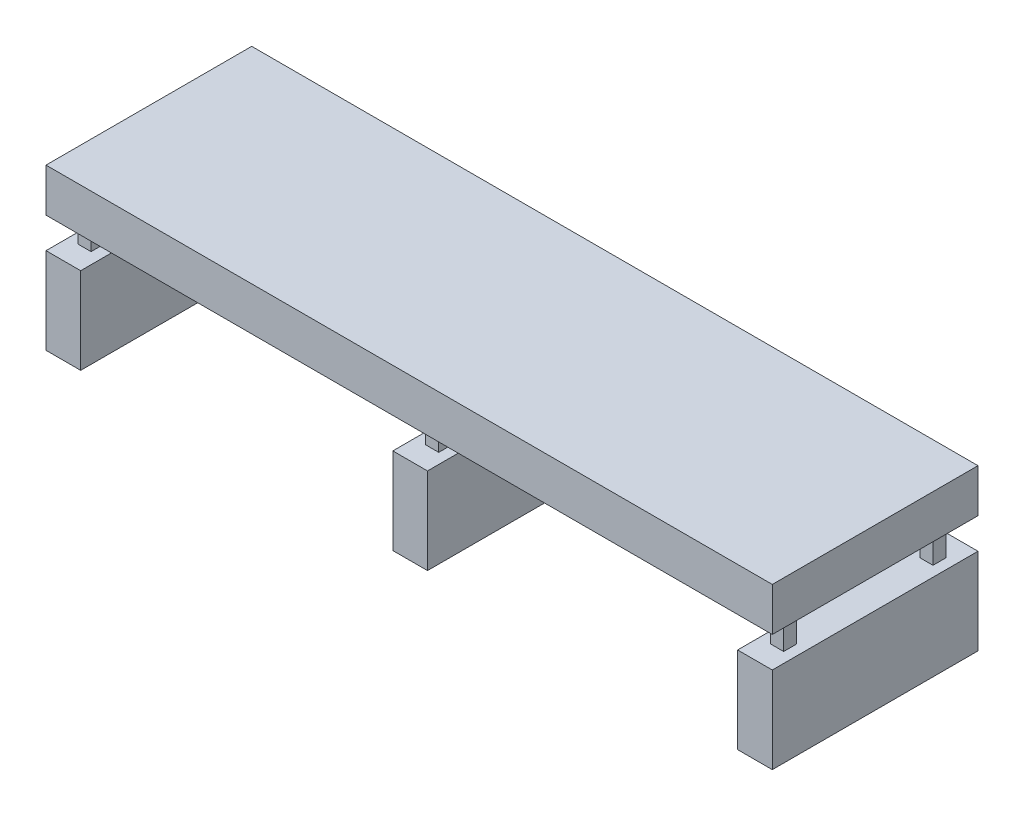
ISO-10303-21;
HEADER;
FILE_DESCRIPTION(('STEP AP214'),'2;1');
FILE_NAME('part.step','',(''),(''),'','','');
FILE_SCHEMA(('AUTOMOTIVE_DESIGN { 1 0 10303 214 1 1 1 1 }'));
ENDSEC;
DATA;
#1=APPLICATION_CONTEXT('core data for automotive mechanical design processes');
#2=APPLICATION_PROTOCOL_DEFINITION('international standard','automotive_design',2000,#1);
#3=PRODUCT_CONTEXT('',#1,'mechanical');
#4=PRODUCT('Part','Part','',(#3));
#5=PRODUCT_RELATED_PRODUCT_CATEGORY('part','',(#4));
#6=PRODUCT_DEFINITION_FORMATION('','',#4);
#7=PRODUCT_DEFINITION_CONTEXT('part definition',#1,'design');
#8=PRODUCT_DEFINITION('design','',#6,#7);
#9=PRODUCT_DEFINITION_SHAPE('','',#8);
#10=(LENGTH_UNIT() NAMED_UNIT(*) SI_UNIT(.MILLI.,.METRE.));
#11=(NAMED_UNIT(*) PLANE_ANGLE_UNIT() SI_UNIT($,.RADIAN.));
#12=(NAMED_UNIT(*) SI_UNIT($,.STERADIAN.) SOLID_ANGLE_UNIT());
#13=UNCERTAINTY_MEASURE_WITH_UNIT(LENGTH_MEASURE(1.E-05),#10,'distance_accuracy_value','');
#14=(GEOMETRIC_REPRESENTATION_CONTEXT(3) GLOBAL_UNCERTAINTY_ASSIGNED_CONTEXT((#13)) GLOBAL_UNIT_ASSIGNED_CONTEXT((#10,
#11,#12)) REPRESENTATION_CONTEXT('',''));
#15=CARTESIAN_POINT('',(0.,0.,0.));
#16=DIRECTION('',(0.,0.,1.));
#17=DIRECTION('',(1.,0.,0.));
#18=AXIS2_PLACEMENT_3D('',#15,#16,#17);
#19=CARTESIAN_POINT('',(2127.25,939.8,602.462599999999));
#20=DIRECTION('',(0.,0.,-1.));
#21=DIRECTION('',(-1.,0.,0.));
#22=AXIS2_PLACEMENT_3D('',#19,#20,#21);
#23=PLANE('',#22);
#24=DIRECTION('',(0.,-1.,0.));
#25=VECTOR('',#24,1.);
#26=CARTESIAN_POINT('',(-1924.05,0.,602.4626));
#27=LINE('',#26,#25);
#28=CARTESIAN_POINT('',(-1924.05,505.683924624355,602.4626));
#29=VERTEX_POINT('',#28);
#30=CARTESIAN_POINT('',(-1924.05,0.,602.4626));
#31=VERTEX_POINT('',#30);
#32=EDGE_CURVE('E352',#29,#31,#27,.T.);
#33=ORIENTED_EDGE('',*,*,#32,.F.);
#34=DIRECTION('',(1.,0.,0.));
#35=VECTOR('',#34,1.);
#36=CARTESIAN_POINT('',(0.,505.683924624355,602.4626));
#37=LINE('',#36,#35);
#38=CARTESIAN_POINT('',(-2127.25,505.683924624355,602.4626));
#39=VERTEX_POINT('',#38);
#40=EDGE_CURVE('E419',#39,#29,#37,.T.);
#41=ORIENTED_EDGE('',*,*,#40,.F.);
#42=DIRECTION('',(0.,-1.,0.));
#43=VECTOR('',#42,1.);
#44=CARTESIAN_POINT('',(-2127.25,939.8,602.4626));
#45=LINE('',#44,#43);
#46=CARTESIAN_POINT('',(-2127.25,0.,602.4626));
#47=VERTEX_POINT('',#46);
#48=EDGE_CURVE('E470',#39,#47,#45,.T.);
#49=ORIENTED_EDGE('',*,*,#48,.T.);
#50=DIRECTION('',(1.,0.,0.));
#51=VECTOR('',#50,1.);
#52=CARTESIAN_POINT('',(2127.25,0.,602.462599999999));
#53=LINE('',#52,#51);
#54=EDGE_CURVE('E449',#47,#31,#53,.T.);
#55=ORIENTED_EDGE('',*,*,#54,.T.);
#56=EDGE_LOOP('',(#33,#41,#49,#55));
#57=FACE_BOUND('',#56,.T.);
#58=ADVANCED_FACE('F36',(#57),#23,.F.);
#59=DIRECTION('',(0.,-1.,0.));
#60=VECTOR('',#59,1.);
#61=CARTESIAN_POINT('',(107.475237350006,0.,602.4626));
#62=LINE('',#61,#60);
#63=CARTESIAN_POINT('',(107.475237350006,505.683924624355,602.4626));
#64=VERTEX_POINT('',#63);
#65=CARTESIAN_POINT('',(107.475237350006,0.,602.4626));
#66=VERTEX_POINT('',#65);
#67=EDGE_CURVE('E341',#64,#66,#62,.T.);
#68=ORIENTED_EDGE('',*,*,#67,.F.);
#69=DIRECTION('',(1.,0.,0.));
#70=VECTOR('',#69,1.);
#71=CARTESIAN_POINT('',(0.,505.683924624355,602.4626));
#72=LINE('',#71,#70);
#73=CARTESIAN_POINT('',(-95.7247626499941,505.683924624355,602.4626));
#74=VERTEX_POINT('',#73);
#75=EDGE_CURVE('E379',#74,#64,#72,.T.);
#76=ORIENTED_EDGE('',*,*,#75,.F.);
#77=DIRECTION('',(0.,-1.,0.));
#78=VECTOR('',#77,1.);
#79=CARTESIAN_POINT('',(-95.7247626499941,0.,602.4626));
#80=LINE('',#79,#78);
#81=CARTESIAN_POINT('',(-95.7247626499941,0.,602.4626));
#82=VERTEX_POINT('',#81);
#83=EDGE_CURVE('E386',#74,#82,#80,.T.);
#84=ORIENTED_EDGE('',*,*,#83,.T.);
#85=EDGE_CURVE('E453',#82,#66,#53,.T.);
#86=ORIENTED_EDGE('',*,*,#85,.T.);
#87=EDGE_LOOP('',(#68,#76,#84,#86));
#88=FACE_BOUND('',#87,.T.);
#89=ADVANCED_FACE('F661',(#88),#23,.F.);
#90=DIRECTION('',(0.,-1.,0.));
#91=VECTOR('',#90,1.);
#92=CARTESIAN_POINT('',(2127.25,939.8,602.462599999999));
#93=LINE('',#92,#91);
#94=CARTESIAN_POINT('',(2127.25,505.683924624355,602.462599999999));
#95=VERTEX_POINT('',#94);
#96=CARTESIAN_POINT('',(2127.25,0.,602.462599999999));
#97=VERTEX_POINT('',#96);
#98=EDGE_CURVE('E467',#95,#97,#93,.T.);
#99=ORIENTED_EDGE('',*,*,#98,.F.);
#100=DIRECTION('',(-1.,0.,0.));
#101=VECTOR('',#100,1.);
#102=CARTESIAN_POINT('',(0.,505.683924624355,602.4626));
#103=LINE('',#102,#101);
#104=CARTESIAN_POINT('',(1924.05,505.683924624355,602.4626));
#105=VERTEX_POINT('',#104);
#106=EDGE_CURVE('E336',#95,#105,#103,.T.);
#107=ORIENTED_EDGE('',*,*,#106,.T.);
#108=DIRECTION('',(0.,-1.,0.));
#109=VECTOR('',#108,1.);
#110=CARTESIAN_POINT('',(1924.05,0.,602.4626));
#111=LINE('',#110,#109);
#112=CARTESIAN_POINT('',(1924.05,0.,602.4626));
#113=VERTEX_POINT('',#112);
#114=EDGE_CURVE('E343',#105,#113,#111,.T.);
#115=ORIENTED_EDGE('',*,*,#114,.T.);
#116=EDGE_CURVE('E448',#113,#97,#53,.T.);
#117=ORIENTED_EDGE('',*,*,#116,.T.);
#118=EDGE_LOOP('',(#99,#107,#115,#117));
#119=FACE_BOUND('',#118,.T.);
#120=ADVANCED_FACE('F512',(#119),#23,.F.);
#121=DIRECTION('',(1.,0.,0.));
#122=VECTOR('',#121,1.);
#123=CARTESIAN_POINT('',(0.,685.8,602.4626));
#124=LINE('',#123,#122);
#125=CARTESIAN_POINT('',(-2127.25,685.8,602.4626));
#126=VERTEX_POINT('',#125);
#127=CARTESIAN_POINT('',(2127.25,685.8,602.4626));
#128=VERTEX_POINT('',#127);
#129=EDGE_CURVE('E393',#126,#128,#124,.T.);
#130=ORIENTED_EDGE('',*,*,#129,.T.);
#131=CARTESIAN_POINT('',(2127.25,939.8,602.462599999999));
#132=VERTEX_POINT('',#131);
#133=EDGE_CURVE('E468',#132,#128,#93,.T.);
#134=ORIENTED_EDGE('',*,*,#133,.F.);
#135=DIRECTION('',(1.,0.,0.));
#136=VECTOR('',#135,1.);
#137=CARTESIAN_POINT('',(2127.25,939.8,602.462599999999));
#138=LINE('',#137,#136);
#139=CARTESIAN_POINT('',(-2127.25,939.8,602.4626));
#140=VERTEX_POINT('',#139);
#141=EDGE_CURVE('E438',#140,#132,#138,.T.);
#142=ORIENTED_EDGE('',*,*,#141,.F.);
#143=EDGE_CURVE('E44',#140,#126,#45,.T.);
#144=ORIENTED_EDGE('',*,*,#143,.T.);
#145=EDGE_LOOP('',(#130,#134,#142,#144));
#146=FACE_BOUND('',#145,.T.);
#147=ADVANCED_FACE('F662',(#146),#23,.F.);
#148=CARTESIAN_POINT('',(-2066.39231203474,0.,-602.4626));
#149=DIRECTION('',(-1.,0.,0.));
#150=DIRECTION('',(0.,0.,1.));
#151=AXIS2_PLACEMENT_3D('',#148,#149,#150);
#152=PLANE('',#151);
#153=DIRECTION('',(0.,-1.,0.));
#154=VECTOR('',#153,1.);
#155=CARTESIAN_POINT('',(-2066.39231203474,0.,475.4626));
#156=LINE('',#155,#154);
#157=CARTESIAN_POINT('',(-2066.39231203473,685.8,475.4626));
#158=VERTEX_POINT('',#157);
#159=CARTESIAN_POINT('',(-2066.39231203473,505.683924624355,475.4626));
#160=VERTEX_POINT('',#159);
#161=EDGE_CURVE('E584',#158,#160,#156,.T.);
#162=ORIENTED_EDGE('',*,*,#161,.F.);
#163=DIRECTION('',(0.,0.,1.));
#164=VECTOR('',#163,1.);
#165=CARTESIAN_POINT('',(-2066.39231203474,685.8,-602.4626));
#166=LINE('',#165,#164);
#167=CARTESIAN_POINT('',(-2066.39231203474,685.8,399.2626));
#168=VERTEX_POINT('',#167);
#169=EDGE_CURVE('E421',#168,#158,#166,.T.);
#170=ORIENTED_EDGE('',*,*,#169,.F.);
#171=DIRECTION('',(0.,-1.,0.));
#172=VECTOR('',#171,1.);
#173=CARTESIAN_POINT('',(-2066.39231203474,-6.17456481365029E-13,399.262599999999));
#174=LINE('',#173,#172);
#175=CARTESIAN_POINT('',(-2066.39231203473,505.683924624355,399.2626));
#176=VERTEX_POINT('',#175);
#177=EDGE_CURVE('E547',#168,#176,#174,.T.);
#178=ORIENTED_EDGE('',*,*,#177,.T.);
#179=DIRECTION('',(0.,0.,1.));
#180=VECTOR('',#179,1.);
#181=CARTESIAN_POINT('',(-2066.39231203474,505.683924624355,-602.4626));
#182=LINE('',#181,#180);
#183=EDGE_CURVE('E428',#176,#160,#182,.T.);
#184=ORIENTED_EDGE('',*,*,#183,.T.);
#185=EDGE_LOOP('',(#162,#170,#178,#184));
#186=FACE_BOUND('',#185,.T.);
#187=ADVANCED_FACE('F669',(#186),#152,.T.);
#188=CARTESIAN_POINT('',(-29.9774835292078,0.,-602.4626));
#189=DIRECTION('',(-1.,0.,0.));
#190=DIRECTION('',(0.,-1.,0.));
#191=AXIS2_PLACEMENT_3D('',#188,#189,#190);
#192=PLANE('',#191);
#193=DIRECTION('',(0.,-1.,0.));
#194=VECTOR('',#193,1.);
#195=CARTESIAN_POINT('',(-29.9774835292078,0.,475.4626));
#196=LINE('',#195,#194);
#197=CARTESIAN_POINT('',(-29.9774835292079,685.8,475.4626));
#198=VERTEX_POINT('',#197);
#199=CARTESIAN_POINT('',(-29.9774835292079,505.683924624355,475.4626));
#200=VERTEX_POINT('',#199);
#201=EDGE_CURVE('E598',#198,#200,#196,.T.);
#202=ORIENTED_EDGE('',*,*,#201,.F.);
#203=DIRECTION('',(0.,0.,1.));
#204=VECTOR('',#203,1.);
#205=CARTESIAN_POINT('',(-29.9774835292079,685.8,-602.4626));
#206=LINE('',#205,#204);
#207=CARTESIAN_POINT('',(-29.9774835292079,685.8,399.2626));
#208=VERTEX_POINT('',#207);
#209=EDGE_CURVE('E384',#208,#198,#206,.T.);
#210=ORIENTED_EDGE('',*,*,#209,.F.);
#211=DIRECTION('',(0.,-1.,0.));
#212=VECTOR('',#211,1.);
#213=CARTESIAN_POINT('',(-29.9774835292078,-6.20921090128263E-13,399.262599999999));
#214=LINE('',#213,#212);
#215=CARTESIAN_POINT('',(-29.9774835292079,505.683924624355,399.2626));
#216=VERTEX_POINT('',#215);
#217=EDGE_CURVE('E555',#208,#216,#214,.T.);
#218=ORIENTED_EDGE('',*,*,#217,.T.);
#219=DIRECTION('',(0.,0.,1.));
#220=VECTOR('',#219,1.);
#221=CARTESIAN_POINT('',(-29.9774835292079,505.683924624355,-602.4626));
#222=LINE('',#221,#220);
#223=EDGE_CURVE('E394',#216,#200,#222,.T.);
#224=ORIENTED_EDGE('',*,*,#223,.T.);
#225=EDGE_LOOP('',(#202,#210,#218,#224));
#226=FACE_BOUND('',#225,.T.);
#227=ADVANCED_FACE('F626',(#226),#192,.T.);
#228=CARTESIAN_POINT('',(-1990.19231203474,0.,-602.4626));
#229=DIRECTION('',(-1.,0.,0.));
#230=DIRECTION('',(0.,0.,1.));
#231=AXIS2_PLACEMENT_3D('',#228,#229,#230);
#232=PLANE('',#231);
#233=DIRECTION('',(0.,0.,1.));
#234=VECTOR('',#233,1.);
#235=CARTESIAN_POINT('',(-1990.19231203474,685.8,-602.4626));
#236=LINE('',#235,#234);
#237=CARTESIAN_POINT('',(-1990.19231203473,685.8,399.2626));
#238=VERTEX_POINT('',#237);
#239=CARTESIAN_POINT('',(-1990.19231203473,685.8,475.4626));
#240=VERTEX_POINT('',#239);
#241=EDGE_CURVE('E412',#238,#240,#236,.T.);
#242=ORIENTED_EDGE('',*,*,#241,.T.);
#243=DIRECTION('',(0.,-1.,0.));
#244=VECTOR('',#243,1.);
#245=CARTESIAN_POINT('',(-1990.19231203474,0.,475.4626));
#246=LINE('',#245,#244);
#247=CARTESIAN_POINT('',(-1990.19231203473,505.683924624355,475.4626));
#248=VERTEX_POINT('',#247);
#249=EDGE_CURVE('E600',#240,#248,#246,.T.);
#250=ORIENTED_EDGE('',*,*,#249,.T.);
#251=DIRECTION('',(0.,0.,1.));
#252=VECTOR('',#251,1.);
#253=CARTESIAN_POINT('',(-1990.19231203474,505.683924624355,-602.4626));
#254=LINE('',#253,#252);
#255=CARTESIAN_POINT('',(-1990.19231203473,505.683924624355,399.2626));
#256=VERTEX_POINT('',#255);
#257=EDGE_CURVE('E408',#256,#248,#254,.T.);
#258=ORIENTED_EDGE('',*,*,#257,.F.);
#259=DIRECTION('',(0.,-1.,0.));
#260=VECTOR('',#259,1.);
#261=CARTESIAN_POINT('',(-1990.19231203474,-6.17456481365029E-13,399.262599999999));
#262=LINE('',#261,#260);
#263=EDGE_CURVE('E558',#238,#256,#262,.T.);
#264=ORIENTED_EDGE('',*,*,#263,.F.);
#265=EDGE_LOOP('',(#242,#250,#258,#264));
#266=FACE_BOUND('',#265,.T.);
#267=ADVANCED_FACE('F653',(#266),#232,.F.);
#268=CARTESIAN_POINT('',(1990.55689312035,0.,-602.4626));
#269=DIRECTION('',(-1.,0.,0.));
#270=DIRECTION('',(0.,0.,1.));
#271=AXIS2_PLACEMENT_3D('',#268,#269,#270);
#272=PLANE('',#271);
#273=DIRECTION('',(0.,-1.,0.));
#274=VECTOR('',#273,1.);
#275=CARTESIAN_POINT('',(1990.55689312035,0.,475.4626));
#276=LINE('',#275,#274);
#277=CARTESIAN_POINT('',(1990.55689312035,685.8,475.4626));
#278=VERTEX_POINT('',#277);
#279=CARTESIAN_POINT('',(1990.55689312035,505.683924624355,475.4626));
#280=VERTEX_POINT('',#279);
#281=EDGE_CURVE('E300',#278,#280,#276,.T.);
#282=ORIENTED_EDGE('',*,*,#281,.F.);
#283=DIRECTION('',(0.,0.,1.));
#284=VECTOR('',#283,1.);
#285=CARTESIAN_POINT('',(1990.55689312035,685.8,-602.4626));
#286=LINE('',#285,#284);
#287=CARTESIAN_POINT('',(1990.55689312035,685.8,399.2626));
#288=VERTEX_POINT('',#287);
#289=EDGE_CURVE('E340',#288,#278,#286,.T.);
#290=ORIENTED_EDGE('',*,*,#289,.F.);
#291=DIRECTION('',(0.,-1.,0.));
#292=VECTOR('',#291,1.);
#293=CARTESIAN_POINT('',(1990.55689312035,-6.17456481365029E-13,399.262599999999));
#294=LINE('',#293,#292);
#295=CARTESIAN_POINT('',(1990.55689312035,505.683924624355,399.2626));
#296=VERTEX_POINT('',#295);
#297=EDGE_CURVE('E560',#288,#296,#294,.T.);
#298=ORIENTED_EDGE('',*,*,#297,.T.);
#299=DIRECTION('',(0.,0.,1.));
#300=VECTOR('',#299,1.);
#301=CARTESIAN_POINT('',(1990.55689312035,505.683924624355,-602.4626));
#302=LINE('',#301,#300);
#303=EDGE_CURVE('E353',#296,#280,#302,.T.);
#304=ORIENTED_EDGE('',*,*,#303,.T.);
#305=EDGE_LOOP('',(#282,#290,#298,#304));
#306=FACE_BOUND('',#305,.T.);
#307=ADVANCED_FACE('F643',(#306),#272,.T.);
#308=CARTESIAN_POINT('',(46.2225164707922,0.,-602.4626));
#309=DIRECTION('',(-1.,0.,0.));
#310=DIRECTION('',(0.,-1.,0.));
#311=AXIS2_PLACEMENT_3D('',#308,#309,#310);
#312=PLANE('',#311);
#313=DIRECTION('',(0.,0.,1.));
#314=VECTOR('',#313,1.);
#315=CARTESIAN_POINT('',(46.2225164707921,685.8,-602.4626));
#316=LINE('',#315,#314);
#317=CARTESIAN_POINT('',(46.2225164707921,685.8,399.2626));
#318=VERTEX_POINT('',#317);
#319=CARTESIAN_POINT('',(46.2225164707921,685.8,475.4626));
#320=VERTEX_POINT('',#319);
#321=EDGE_CURVE('E371',#318,#320,#316,.T.);
#322=ORIENTED_EDGE('',*,*,#321,.T.);
#323=DIRECTION('',(0.,-1.,0.));
#324=VECTOR('',#323,1.);
#325=CARTESIAN_POINT('',(46.2225164707922,0.,475.4626));
#326=LINE('',#325,#324);
#327=CARTESIAN_POINT('',(46.2225164707921,505.683924624355,475.4626));
#328=VERTEX_POINT('',#327);
#329=EDGE_CURVE('E316',#320,#328,#326,.T.);
#330=ORIENTED_EDGE('',*,*,#329,.T.);
#331=DIRECTION('',(0.,0.,1.));
#332=VECTOR('',#331,1.);
#333=CARTESIAN_POINT('',(46.2225164707921,505.683924624355,-602.4626));
#334=LINE('',#333,#332);
#335=CARTESIAN_POINT('',(46.2225164707921,505.683924624355,399.2626));
#336=VERTEX_POINT('',#335);
#337=EDGE_CURVE('E367',#336,#328,#334,.T.);
#338=ORIENTED_EDGE('',*,*,#337,.F.);
#339=DIRECTION('',(0.,-1.,0.));
#340=VECTOR('',#339,1.);
#341=CARTESIAN_POINT('',(46.2225164707922,-6.10333671541563E-13,399.262599999999));
#342=LINE('',#341,#340);
#343=EDGE_CURVE('E563',#318,#336,#342,.T.);
#344=ORIENTED_EDGE('',*,*,#343,.F.);
#345=EDGE_LOOP('',(#322,#330,#338,#344));
#346=FACE_BOUND('',#345,.T.);
#347=ADVANCED_FACE('F641',(#346),#312,.F.);
#348=CARTESIAN_POINT('',(2066.75689312035,0.,-602.4626));
#349=DIRECTION('',(-1.,0.,0.));
#350=DIRECTION('',(0.,0.,1.));
#351=AXIS2_PLACEMENT_3D('',#348,#349,#350);
#352=PLANE('',#351);
#353=DIRECTION('',(0.,0.,1.));
#354=VECTOR('',#353,1.);
#355=CARTESIAN_POINT('',(2066.75689312035,685.8,-602.4626));
#356=LINE('',#355,#354);
#357=CARTESIAN_POINT('',(2066.75689312035,685.8,399.2626));
#358=VERTEX_POINT('',#357);
#359=CARTESIAN_POINT('',(2066.75689312035,685.8,475.4626));
#360=VERTEX_POINT('',#359);
#361=EDGE_CURVE('E315',#358,#360,#356,.T.);
#362=ORIENTED_EDGE('',*,*,#361,.T.);
#363=DIRECTION('',(0.,-1.,0.));
#364=VECTOR('',#363,1.);
#365=CARTESIAN_POINT('',(2066.75689312035,0.,475.4626));
#366=LINE('',#365,#364);
#367=CARTESIAN_POINT('',(2066.75689312035,505.683924624355,475.4626));
#368=VERTEX_POINT('',#367);
#369=EDGE_CURVE('E297',#360,#368,#366,.T.);
#370=ORIENTED_EDGE('',*,*,#369,.T.);
#371=DIRECTION('',(0.,0.,1.));
#372=VECTOR('',#371,1.);
#373=CARTESIAN_POINT('',(2066.75689312035,505.683924624355,-602.4626));
#374=LINE('',#373,#372);
#375=CARTESIAN_POINT('',(2066.75689312035,505.683924624355,399.2626));
#376=VERTEX_POINT('',#375);
#377=EDGE_CURVE('E313',#376,#368,#374,.T.);
#378=ORIENTED_EDGE('',*,*,#377,.F.);
#379=DIRECTION('',(0.,-1.,0.));
#380=VECTOR('',#379,1.);
#381=CARTESIAN_POINT('',(2066.75689312035,-6.17456481365029E-13,399.262599999999));
#382=LINE('',#381,#380);
#383=EDGE_CURVE('E565',#358,#376,#382,.T.);
#384=ORIENTED_EDGE('',*,*,#383,.F.);
#385=EDGE_LOOP('',(#362,#370,#378,#384));
#386=FACE_BOUND('',#385,.T.);
#387=ADVANCED_FACE('F311',(#386),#352,.F.);
#388=CARTESIAN_POINT('',(2127.25,939.8,-602.4626));
#389=DIRECTION('',(0.,0.,1.));
#390=DIRECTION('',(1.,0.,0.));
#391=AXIS2_PLACEMENT_3D('',#388,#389,#390);
#392=PLANE('',#391);
#393=DIRECTION('',(-1.,0.,0.));
#394=VECTOR('',#393,1.);
#395=CARTESIAN_POINT('',(0.,505.683924624355,-602.4626));
#396=LINE('',#395,#394);
#397=CARTESIAN_POINT('',(2127.25,505.683924624355,-602.4626));
#398=VERTEX_POINT('',#397);
#399=CARTESIAN_POINT('',(1924.05,505.683924624355,-602.4626));
#400=VERTEX_POINT('',#399);
#401=EDGE_CURVE('E338',#398,#400,#396,.T.);
#402=ORIENTED_EDGE('',*,*,#401,.F.);
#403=DIRECTION('',(0.,-1.,0.));
#404=VECTOR('',#403,1.);
#405=CARTESIAN_POINT('',(2127.25,939.8,-602.4626));
#406=LINE('',#405,#404);
#407=CARTESIAN_POINT('',(2127.25,0.,-602.4626));
#408=VERTEX_POINT('',#407);
#409=EDGE_CURVE('E463',#398,#408,#406,.T.);
#410=ORIENTED_EDGE('',*,*,#409,.T.);
#411=DIRECTION('',(-1.,0.,0.));
#412=VECTOR('',#411,1.);
#413=CARTESIAN_POINT('',(2127.25,0.,-602.4626));
#414=LINE('',#413,#412);
#415=CARTESIAN_POINT('',(1924.05,0.,-602.4626));
#416=VERTEX_POINT('',#415);
#417=EDGE_CURVE('E439',#408,#416,#414,.T.);
#418=ORIENTED_EDGE('',*,*,#417,.T.);
#419=DIRECTION('',(0.,-1.,0.));
#420=VECTOR('',#419,1.);
#421=CARTESIAN_POINT('',(1924.05,0.,-602.4626));
#422=LINE('',#421,#420);
#423=EDGE_CURVE('E335',#400,#416,#422,.T.);
#424=ORIENTED_EDGE('',*,*,#423,.F.);
#425=EDGE_LOOP('',(#402,#410,#418,#424));
#426=FACE_BOUND('',#425,.T.);
#427=ADVANCED_FACE('F650',(#426),#392,.F.);
#428=DIRECTION('',(1.,0.,0.));
#429=VECTOR('',#428,1.);
#430=CARTESIAN_POINT('',(0.,505.683924624355,-602.4626));
#431=LINE('',#430,#429);
#432=CARTESIAN_POINT('',(-95.7247626499941,505.683924624355,-602.4626));
#433=VERTEX_POINT('',#432);
#434=CARTESIAN_POINT('',(107.475237350006,505.683924624355,-602.4626));
#435=VERTEX_POINT('',#434);
#436=EDGE_CURVE('E382',#433,#435,#431,.T.);
#437=ORIENTED_EDGE('',*,*,#436,.T.);
#438=DIRECTION('',(0.,-1.,0.));
#439=VECTOR('',#438,1.);
#440=CARTESIAN_POINT('',(107.475237350006,0.,-602.4626));
#441=LINE('',#440,#439);
#442=CARTESIAN_POINT('',(107.475237350006,0.,-602.4626));
#443=VERTEX_POINT('',#442);
#444=EDGE_CURVE('E332',#435,#443,#441,.T.);
#445=ORIENTED_EDGE('',*,*,#444,.T.);
#446=CARTESIAN_POINT('',(-95.7247626499941,0.,-602.4626));
#447=VERTEX_POINT('',#446);
#448=EDGE_CURVE('E459',#443,#447,#414,.T.);
#449=ORIENTED_EDGE('',*,*,#448,.T.);
#450=DIRECTION('',(0.,-1.,0.));
#451=VECTOR('',#450,1.);
#452=CARTESIAN_POINT('',(-95.7247626499941,0.,-602.4626));
#453=LINE('',#452,#451);
#454=EDGE_CURVE('E378',#433,#447,#453,.T.);
#455=ORIENTED_EDGE('',*,*,#454,.F.);
#456=EDGE_LOOP('',(#437,#445,#449,#455));
#457=FACE_BOUND('',#456,.T.);
#458=ADVANCED_FACE('F494',(#457),#392,.F.);
#459=DIRECTION('',(1.,0.,0.));
#460=VECTOR('',#459,1.);
#461=CARTESIAN_POINT('',(0.,505.683924624355,-602.4626));
#462=LINE('',#461,#460);
#463=CARTESIAN_POINT('',(-2127.25,505.683924624355,-602.4626));
#464=VERTEX_POINT('',#463);
#465=CARTESIAN_POINT('',(-1924.05,505.683924624355,-602.4626));
#466=VERTEX_POINT('',#465);
#467=EDGE_CURVE('E418',#464,#466,#462,.T.);
#468=ORIENTED_EDGE('',*,*,#467,.T.);
#469=DIRECTION('',(0.,-1.,0.));
#470=VECTOR('',#469,1.);
#471=CARTESIAN_POINT('',(-1924.05,0.,-602.4626));
#472=LINE('',#471,#470);
#473=CARTESIAN_POINT('',(-1924.05,0.,-602.4626));
#474=VERTEX_POINT('',#473);
#475=EDGE_CURVE('E375',#466,#474,#472,.T.);
#476=ORIENTED_EDGE('',*,*,#475,.T.);
#477=CARTESIAN_POINT('',(-2127.25,0.,-602.4626));
#478=VERTEX_POINT('',#477);
#479=EDGE_CURVE('E456',#474,#478,#414,.T.);
#480=ORIENTED_EDGE('',*,*,#479,.T.);
#481=DIRECTION('',(0.,-1.,0.));
#482=VECTOR('',#481,1.);
#483=CARTESIAN_POINT('',(-2127.25,939.8,-602.4626));
#484=LINE('',#483,#482);
#485=EDGE_CURVE('E445',#464,#478,#484,.T.);
#486=ORIENTED_EDGE('',*,*,#485,.F.);
#487=EDGE_LOOP('',(#468,#476,#480,#486));
#488=FACE_BOUND('',#487,.T.);
#489=ADVANCED_FACE('F488',(#488),#392,.F.);
#490=DIRECTION('',(0.,-1.,0.));
#491=VECTOR('',#490,1.);
#492=CARTESIAN_POINT('',(-2066.39231203474,0.,-399.2626));
#493=LINE('',#492,#491);
#494=CARTESIAN_POINT('',(-2066.39231203473,685.8,-399.2626));
#495=VERTEX_POINT('',#494);
#496=CARTESIAN_POINT('',(-2066.39231203473,505.683924624355,-399.2626));
#497=VERTEX_POINT('',#496);
#498=EDGE_CURVE('E567',#495,#497,#493,.T.);
#499=ORIENTED_EDGE('',*,*,#498,.F.);
#500=CARTESIAN_POINT('',(-2066.39231203473,685.8,-475.4626));
#501=VERTEX_POINT('',#500);
#502=EDGE_CURVE('E433',#501,#495,#166,.T.);
#503=ORIENTED_EDGE('',*,*,#502,.F.);
#504=DIRECTION('',(0.,-1.,0.));
#505=VECTOR('',#504,1.);
#506=CARTESIAN_POINT('',(-2066.39231203474,0.,-475.4626));
#507=LINE('',#506,#505);
#508=CARTESIAN_POINT('',(-2066.39231203473,505.683924624355,-475.4626));
#509=VERTEX_POINT('',#508);
#510=EDGE_CURVE('E528',#501,#509,#507,.T.);
#511=ORIENTED_EDGE('',*,*,#510,.T.);
#512=EDGE_CURVE('E424',#509,#497,#182,.T.);
#513=ORIENTED_EDGE('',*,*,#512,.T.);
#514=EDGE_LOOP('',(#499,#503,#511,#513));
#515=FACE_BOUND('',#514,.T.);
#516=ADVANCED_FACE('F677',(#515),#152,.T.);
#517=DIRECTION('',(0.,-1.,0.));
#518=VECTOR('',#517,1.);
#519=CARTESIAN_POINT('',(-29.9774835292078,0.,-399.2626));
#520=LINE('',#519,#518);
#521=CARTESIAN_POINT('',(-29.9774835292079,685.8,-399.2626));
#522=VERTEX_POINT('',#521);
#523=CARTESIAN_POINT('',(-29.9774835292079,505.683924624355,-399.2626));
#524=VERTEX_POINT('',#523);
#525=EDGE_CURVE('E569',#522,#524,#520,.T.);
#526=ORIENTED_EDGE('',*,*,#525,.F.);
#527=CARTESIAN_POINT('',(-29.9774835292079,685.8,-475.4626));
#528=VERTEX_POINT('',#527);
#529=EDGE_CURVE('E413',#528,#522,#206,.T.);
#530=ORIENTED_EDGE('',*,*,#529,.F.);
#531=DIRECTION('',(0.,-1.,0.));
#532=VECTOR('',#531,1.);
#533=CARTESIAN_POINT('',(-29.9774835292078,0.,-475.4626));
#534=LINE('',#533,#532);
#535=CARTESIAN_POINT('',(-29.9774835292079,505.683924624355,-475.4626));
#536=VERTEX_POINT('',#535);
#537=EDGE_CURVE('E531',#528,#536,#534,.T.);
#538=ORIENTED_EDGE('',*,*,#537,.T.);
#539=EDGE_CURVE('E390',#536,#524,#222,.T.);
#540=ORIENTED_EDGE('',*,*,#539,.T.);
#541=EDGE_LOOP('',(#526,#530,#538,#540));
#542=FACE_BOUND('',#541,.T.);
#543=ADVANCED_FACE('F705',(#542),#192,.T.);
#544=CARTESIAN_POINT('',(-1990.19231203473,685.8,-475.4626));
#545=VERTEX_POINT('',#544);
#546=CARTESIAN_POINT('',(-1990.19231203474,685.8,-399.2626));
#547=VERTEX_POINT('',#546);
#548=EDGE_CURVE('E409',#545,#547,#236,.T.);
#549=ORIENTED_EDGE('',*,*,#548,.T.);
#550=DIRECTION('',(0.,-1.,0.));
#551=VECTOR('',#550,1.);
#552=CARTESIAN_POINT('',(-1990.19231203474,0.,-399.2626));
#553=LINE('',#552,#551);
#554=CARTESIAN_POINT('',(-1990.19231203473,505.683924624355,-399.2626));
#555=VERTEX_POINT('',#554);
#556=EDGE_CURVE('E571',#547,#555,#553,.T.);
#557=ORIENTED_EDGE('',*,*,#556,.T.);
#558=CARTESIAN_POINT('',(-1990.19231203474,505.683924624355,-475.4626));
#559=VERTEX_POINT('',#558);
#560=EDGE_CURVE('E405',#559,#555,#254,.T.);
#561=ORIENTED_EDGE('',*,*,#560,.F.);
#562=DIRECTION('',(0.,-1.,0.));
#563=VECTOR('',#562,1.);
#564=CARTESIAN_POINT('',(-1990.19231203474,0.,-475.4626));
#565=LINE('',#564,#563);
#566=EDGE_CURVE('E534',#545,#559,#565,.T.);
#567=ORIENTED_EDGE('',*,*,#566,.F.);
#568=EDGE_LOOP('',(#549,#557,#561,#567));
#569=FACE_BOUND('',#568,.T.);
#570=ADVANCED_FACE('F713',(#569),#232,.F.);
#571=DIRECTION('',(0.,-1.,0.));
#572=VECTOR('',#571,1.);
#573=CARTESIAN_POINT('',(1990.55689312035,0.,-399.2626));
#574=LINE('',#573,#572);
#575=CARTESIAN_POINT('',(1990.55689312035,685.8,-399.2626));
#576=VERTEX_POINT('',#575);
#577=CARTESIAN_POINT('',(1990.55689312035,505.683924624355,-399.2626));
#578=VERTEX_POINT('',#577);
#579=EDGE_CURVE('E574',#576,#578,#574,.T.);
#580=ORIENTED_EDGE('',*,*,#579,.F.);
#581=CARTESIAN_POINT('',(1990.55689312035,685.8,-475.4626));
#582=VERTEX_POINT('',#581);
#583=EDGE_CURVE('E372',#582,#576,#286,.T.);
#584=ORIENTED_EDGE('',*,*,#583,.F.);
#585=DIRECTION('',(0.,-1.,0.));
#586=VECTOR('',#585,1.);
#587=CARTESIAN_POINT('',(1990.55689312035,0.,-475.4626));
#588=LINE('',#587,#586);
#589=CARTESIAN_POINT('',(1990.55689312035,505.683924624355,-475.4626));
#590=VERTEX_POINT('',#589);
#591=EDGE_CURVE('E537',#582,#590,#588,.T.);
#592=ORIENTED_EDGE('',*,*,#591,.T.);
#593=EDGE_CURVE('E349',#590,#578,#302,.T.);
#594=ORIENTED_EDGE('',*,*,#593,.T.);
#595=EDGE_LOOP('',(#580,#584,#592,#594));
#596=FACE_BOUND('',#595,.T.);
#597=ADVANCED_FACE('F656',(#596),#272,.T.);
#598=CARTESIAN_POINT('',(46.2225164707921,685.8,-475.4626));
#599=VERTEX_POINT('',#598);
#600=CARTESIAN_POINT('',(46.2225164707921,685.8,-399.2626));
#601=VERTEX_POINT('',#600);
#602=EDGE_CURVE('E368',#599,#601,#316,.T.);
#603=ORIENTED_EDGE('',*,*,#602,.T.);
#604=DIRECTION('',(0.,-1.,0.));
#605=VECTOR('',#604,1.);
#606=CARTESIAN_POINT('',(46.2225164707922,0.,-399.2626));
#607=LINE('',#606,#605);
#608=CARTESIAN_POINT('',(46.2225164707921,505.683924624355,-399.2626));
#609=VERTEX_POINT('',#608);
#610=EDGE_CURVE('E576',#601,#609,#607,.T.);
#611=ORIENTED_EDGE('',*,*,#610,.T.);
#612=CARTESIAN_POINT('',(46.2225164707921,505.683924624355,-475.4626));
#613=VERTEX_POINT('',#612);
#614=EDGE_CURVE('E364',#613,#609,#334,.T.);
#615=ORIENTED_EDGE('',*,*,#614,.F.);
#616=DIRECTION('',(0.,-1.,0.));
#617=VECTOR('',#616,1.);
#618=CARTESIAN_POINT('',(46.2225164707922,0.,-475.4626));
#619=LINE('',#618,#617);
#620=EDGE_CURVE('E540',#599,#613,#619,.T.);
#621=ORIENTED_EDGE('',*,*,#620,.F.);
#622=EDGE_LOOP('',(#603,#611,#615,#621));
#623=FACE_BOUND('',#622,.T.);
#624=ADVANCED_FACE('F645',(#623),#312,.F.);
#625=CARTESIAN_POINT('',(2066.75689312035,685.8,-475.4626));
#626=VERTEX_POINT('',#625);
#627=CARTESIAN_POINT('',(2066.75689312035,685.8,-399.2626));
#628=VERTEX_POINT('',#627);
#629=EDGE_CURVE('E323',#626,#628,#356,.T.);
#630=ORIENTED_EDGE('',*,*,#629,.T.);
#631=DIRECTION('',(0.,-1.,0.));
#632=VECTOR('',#631,1.);
#633=CARTESIAN_POINT('',(2066.75689312035,0.,-399.2626));
#634=LINE('',#633,#632);
#635=CARTESIAN_POINT('',(2066.75689312035,505.683924624355,-399.2626));
#636=VERTEX_POINT('',#635);
#637=EDGE_CURVE('E579',#628,#636,#634,.T.);
#638=ORIENTED_EDGE('',*,*,#637,.T.);
#639=CARTESIAN_POINT('',(2066.75689312035,505.683924624355,-475.4626));
#640=VERTEX_POINT('',#639);
#641=EDGE_CURVE('E322',#640,#636,#374,.T.);
#642=ORIENTED_EDGE('',*,*,#641,.F.);
#643=DIRECTION('',(0.,-1.,0.));
#644=VECTOR('',#643,1.);
#645=CARTESIAN_POINT('',(2066.75689312035,0.,-475.4626));
#646=LINE('',#645,#644);
#647=EDGE_CURVE('E11',#626,#640,#646,.T.);
#648=ORIENTED_EDGE('',*,*,#647,.F.);
#649=EDGE_LOOP('',(#630,#638,#642,#648));
#650=FACE_BOUND('',#649,.T.);
#651=ADVANCED_FACE('F652',(#650),#352,.F.);
#652=CARTESIAN_POINT('',(2127.25,939.8,-602.4626));
#653=VERTEX_POINT('',#652);
#654=CARTESIAN_POINT('',(2127.25,685.8,-602.4626));
#655=VERTEX_POINT('',#654);
#656=EDGE_CURVE('E464',#653,#655,#406,.T.);
#657=ORIENTED_EDGE('',*,*,#656,.T.);
#658=DIRECTION('',(1.,0.,0.));
#659=VECTOR('',#658,1.);
#660=CARTESIAN_POINT('',(0.,685.8,-602.4626));
#661=LINE('',#660,#659);
#662=CARTESIAN_POINT('',(-2127.25,685.8,-602.4626));
#663=VERTEX_POINT('',#662);
#664=EDGE_CURVE('E416',#663,#655,#661,.T.);
#665=ORIENTED_EDGE('',*,*,#664,.F.);
#666=CARTESIAN_POINT('',(-2127.25,939.8,-602.4626));
#667=VERTEX_POINT('',#666);
#668=EDGE_CURVE('E460',#667,#663,#484,.T.);
#669=ORIENTED_EDGE('',*,*,#668,.F.);
#670=DIRECTION('',(-1.,0.,0.));
#671=VECTOR('',#670,1.);
#672=CARTESIAN_POINT('',(2127.25,939.8,-602.4626));
#673=LINE('',#672,#671);
#674=EDGE_CURVE('E443',#653,#667,#673,.T.);
#675=ORIENTED_EDGE('',*,*,#674,.F.);
#676=EDGE_LOOP('',(#657,#665,#669,#675));
#677=FACE_BOUND('',#676,.T.);
#678=ADVANCED_FACE('F684',(#677),#392,.F.);
#679=CARTESIAN_POINT('',(2127.25,939.8,602.462599999999));
#680=DIRECTION('',(-1.,0.,0.));
#681=DIRECTION('',(0.,0.,1.));
#682=AXIS2_PLACEMENT_3D('',#679,#680,#681);
#683=PLANE('',#682);
#684=DIRECTION('',(0.,0.,1.));
#685=VECTOR('',#684,1.);
#686=CARTESIAN_POINT('',(2127.25,685.8,-602.4626));
#687=LINE('',#686,#685);
#688=EDGE_CURVE('E344',#655,#128,#687,.T.);
#689=ORIENTED_EDGE('',*,*,#688,.F.);
#690=ORIENTED_EDGE('',*,*,#656,.F.);
#691=DIRECTION('',(0.,0.,-1.));
#692=VECTOR('',#691,1.);
#693=CARTESIAN_POINT('',(2127.25,939.8,602.462599999999));
#694=LINE('',#693,#692);
#695=EDGE_CURVE('E441',#132,#653,#694,.T.);
#696=ORIENTED_EDGE('',*,*,#695,.F.);
#697=ORIENTED_EDGE('',*,*,#133,.T.);
#698=EDGE_LOOP('',(#689,#690,#696,#697));
#699=FACE_BOUND('',#698,.T.);
#700=ADVANCED_FACE('F692',(#699),#683,.F.);
#701=DIRECTION('',(0.,0.,1.));
#702=VECTOR('',#701,1.);
#703=CARTESIAN_POINT('',(2127.25,505.683924624355,-602.4626));
#704=LINE('',#703,#702);
#705=EDGE_CURVE('E326',#398,#95,#704,.T.);
#706=ORIENTED_EDGE('',*,*,#705,.T.);
#707=ORIENTED_EDGE('',*,*,#98,.T.);
#708=DIRECTION('',(0.,0.,-1.));
#709=VECTOR('',#708,1.);
#710=CARTESIAN_POINT('',(2127.25,0.,602.462599999999));
#711=LINE('',#710,#709);
#712=EDGE_CURVE('E452',#97,#408,#711,.T.);
#713=ORIENTED_EDGE('',*,*,#712,.T.);
#714=ORIENTED_EDGE('',*,*,#409,.F.);
#715=EDGE_LOOP('',(#706,#707,#713,#714));
#716=FACE_BOUND('',#715,.T.);
#717=ADVANCED_FACE('F521',(#716),#683,.F.);
#718=CARTESIAN_POINT('',(0.,0.,0.));
#719=DIRECTION('',(0.,1.,0.));
#720=DIRECTION('',(0.,0.,1.));
#721=AXIS2_PLACEMENT_3D('',#718,#719,#720);
#722=PLANE('',#721);
#723=DIRECTION('',(0.,0.,1.));
#724=VECTOR('',#723,1.);
#725=CARTESIAN_POINT('',(1924.05,0.,-602.4626));
#726=LINE('',#725,#724);
#727=EDGE_CURVE('E356',#416,#113,#726,.T.);
#728=ORIENTED_EDGE('',*,*,#727,.F.);
#729=ORIENTED_EDGE('',*,*,#417,.F.);
#730=ORIENTED_EDGE('',*,*,#712,.F.);
#731=ORIENTED_EDGE('',*,*,#116,.F.);
#732=EDGE_LOOP('',(#728,#729,#730,#731));
#733=FACE_BOUND('',#732,.T.);
#734=ADVANCED_FACE('F517',(#733),#722,.F.);
#735=ORIENTED_EDGE('',*,*,#448,.F.);
#736=DIRECTION('',(0.,0.,1.));
#737=VECTOR('',#736,1.);
#738=CARTESIAN_POINT('',(107.475237350006,0.,-602.4626));
#739=LINE('',#738,#737);
#740=EDGE_CURVE('E358',#443,#66,#739,.T.);
#741=ORIENTED_EDGE('',*,*,#740,.T.);
#742=ORIENTED_EDGE('',*,*,#85,.F.);
#743=DIRECTION('',(0.,0.,1.));
#744=VECTOR('',#743,1.);
#745=CARTESIAN_POINT('',(-95.7247626499941,0.,-602.4626));
#746=LINE('',#745,#744);
#747=EDGE_CURVE('E397',#447,#82,#746,.T.);
#748=ORIENTED_EDGE('',*,*,#747,.F.);
#749=EDGE_LOOP('',(#735,#741,#742,#748));
#750=FACE_BOUND('',#749,.T.);
#751=ADVANCED_FACE('F503',(#750),#722,.F.);
#752=CARTESIAN_POINT('',(-2127.25,939.8,602.4626));
#753=DIRECTION('',(1.,0.,0.));
#754=DIRECTION('',(0.,0.,-1.));
#755=AXIS2_PLACEMENT_3D('',#752,#753,#754);
#756=PLANE('',#755);
#757=DIRECTION('',(0.,0.,1.));
#758=VECTOR('',#757,1.);
#759=CARTESIAN_POINT('',(-2127.25,685.8,-602.4626));
#760=LINE('',#759,#758);
#761=EDGE_CURVE('E431',#663,#126,#760,.T.);
#762=ORIENTED_EDGE('',*,*,#761,.T.);
#763=ORIENTED_EDGE('',*,*,#143,.F.);
#764=DIRECTION('',(0.,0.,1.));
#765=VECTOR('',#764,1.);
#766=CARTESIAN_POINT('',(-2127.25,939.8,602.4626));
#767=LINE('',#766,#765);
#768=EDGE_CURVE('E435',#667,#140,#767,.T.);
#769=ORIENTED_EDGE('',*,*,#768,.F.);
#770=ORIENTED_EDGE('',*,*,#668,.T.);
#771=EDGE_LOOP('',(#762,#763,#769,#770));
#772=FACE_BOUND('',#771,.T.);
#773=ADVANCED_FACE('F688',(#772),#756,.F.);
#774=ORIENTED_EDGE('',*,*,#48,.F.);
#775=DIRECTION('',(0.,0.,1.));
#776=VECTOR('',#775,1.);
#777=CARTESIAN_POINT('',(-2127.25,505.683924624355,-602.4626));
#778=LINE('',#777,#776);
#779=EDGE_CURVE('E429',#464,#39,#778,.T.);
#780=ORIENTED_EDGE('',*,*,#779,.F.);
#781=ORIENTED_EDGE('',*,*,#485,.T.);
#782=DIRECTION('',(0.,0.,1.));
#783=VECTOR('',#782,1.);
#784=CARTESIAN_POINT('',(-2127.25,0.,602.4626));
#785=LINE('',#784,#783);
#786=EDGE_CURVE('E427',#478,#47,#785,.T.);
#787=ORIENTED_EDGE('',*,*,#786,.T.);
#788=EDGE_LOOP('',(#774,#780,#781,#787));
#789=FACE_BOUND('',#788,.T.);
#790=ADVANCED_FACE('F38',(#789),#756,.F.);
#791=CARTESIAN_POINT('',(0.,939.8,0.));
#792=DIRECTION('',(0.,1.,0.));
#793=DIRECTION('',(0.,0.,1.));
#794=AXIS2_PLACEMENT_3D('',#791,#792,#793);
#795=PLANE('',#794);
#796=ORIENTED_EDGE('',*,*,#768,.T.);
#797=ORIENTED_EDGE('',*,*,#141,.T.);
#798=ORIENTED_EDGE('',*,*,#695,.T.);
#799=ORIENTED_EDGE('',*,*,#674,.T.);
#800=EDGE_LOOP('',(#796,#797,#798,#799));
#801=FACE_BOUND('',#800,.T.);
#802=ADVANCED_FACE('F690',(#801),#795,.T.);
#803=ORIENTED_EDGE('',*,*,#479,.F.);
#804=DIRECTION('',(0.,0.,1.));
#805=VECTOR('',#804,1.);
#806=CARTESIAN_POINT('',(-1924.05,0.,-602.4626));
#807=LINE('',#806,#805);
#808=EDGE_CURVE('E399',#474,#31,#807,.T.);
#809=ORIENTED_EDGE('',*,*,#808,.T.);
#810=ORIENTED_EDGE('',*,*,#54,.F.);
#811=ORIENTED_EDGE('',*,*,#786,.F.);
#812=EDGE_LOOP('',(#803,#809,#810,#811));
#813=FACE_BOUND('',#812,.T.);
#814=ADVANCED_FACE('F484',(#813),#722,.F.);
#815=CARTESIAN_POINT('',(0.,505.683924624355,-602.4626));
#816=DIRECTION('',(0.,-1.,0.));
#817=DIRECTION('',(0.,0.,-1.));
#818=AXIS2_PLACEMENT_3D('',#815,#816,#817);
#819=PLANE('',#818);
#820=DIRECTION('',(-1.,0.,0.));
#821=VECTOR('',#820,1.);
#822=CARTESIAN_POINT('',(2127.25,505.683924624355,475.4626));
#823=LINE('',#822,#821);
#824=EDGE_CURVE('E307',#248,#160,#823,.T.);
#825=ORIENTED_EDGE('',*,*,#824,.T.);
#826=ORIENTED_EDGE('',*,*,#183,.F.);
#827=DIRECTION('',(-1.,0.,0.));
#828=VECTOR('',#827,1.);
#829=CARTESIAN_POINT('',(2127.25,505.683924624355,399.2626));
#830=LINE('',#829,#828);
#831=EDGE_CURVE('E594',#256,#176,#830,.T.);
#832=ORIENTED_EDGE('',*,*,#831,.F.);
#833=ORIENTED_EDGE('',*,*,#257,.T.);
#834=EDGE_LOOP('',(#825,#826,#832,#833));
#835=FACE_BOUND('',#834,.T.);
#836=DIRECTION('',(-1.,0.,0.));
#837=VECTOR('',#836,1.);
#838=CARTESIAN_POINT('',(2127.25,505.683924624355,-399.2626));
#839=LINE('',#838,#837);
#840=EDGE_CURVE('E589',#555,#497,#839,.T.);
#841=ORIENTED_EDGE('',*,*,#840,.T.);
#842=ORIENTED_EDGE('',*,*,#512,.F.);
#843=DIRECTION('',(-1.,0.,0.));
#844=VECTOR('',#843,1.);
#845=CARTESIAN_POINT('',(2127.25,505.683924624355,-475.4626));
#846=LINE('',#845,#844);
#847=EDGE_CURVE('E544',#559,#509,#846,.T.);
#848=ORIENTED_EDGE('',*,*,#847,.F.);
#849=ORIENTED_EDGE('',*,*,#560,.T.);
#850=EDGE_LOOP('',(#841,#842,#848,#849));
#851=FACE_BOUND('',#850,.T.);
#852=ORIENTED_EDGE('',*,*,#779,.T.);
#853=ORIENTED_EDGE('',*,*,#40,.T.);
#854=DIRECTION('',(0.,0.,1.));
#855=VECTOR('',#854,1.);
#856=CARTESIAN_POINT('',(-1924.05,505.683924624355,-602.4626));
#857=LINE('',#856,#855);
#858=EDGE_CURVE('E402',#466,#29,#857,.T.);
#859=ORIENTED_EDGE('',*,*,#858,.F.);
#860=ORIENTED_EDGE('',*,*,#467,.F.);
#861=EDGE_LOOP('',(#852,#853,#859,#860));
#862=FACE_BOUND('',#861,.T.);
#863=ADVANCED_FACE('F701',(#835,#851,#862),#819,.F.);
#864=CARTESIAN_POINT('',(0.,685.8,-602.4626));
#865=DIRECTION('',(0.,-1.,0.));
#866=DIRECTION('',(0.,0.,-1.));
#867=AXIS2_PLACEMENT_3D('',#864,#865,#866);
#868=PLANE('',#867);
#869=ORIENTED_EDGE('',*,*,#688,.T.);
#870=ORIENTED_EDGE('',*,*,#129,.F.);
#871=ORIENTED_EDGE('',*,*,#761,.F.);
#872=ORIENTED_EDGE('',*,*,#664,.T.);
#873=EDGE_LOOP('',(#869,#870,#871,#872));
#874=FACE_BOUND('',#873,.T.);
#875=ORIENTED_EDGE('',*,*,#169,.T.);
#876=DIRECTION('',(-1.,0.,0.));
#877=VECTOR('',#876,1.);
#878=CARTESIAN_POINT('',(2127.25,685.8,475.4626));
#879=LINE('',#878,#877);
#880=EDGE_CURVE('E606',#240,#158,#879,.T.);
#881=ORIENTED_EDGE('',*,*,#880,.F.);
#882=ORIENTED_EDGE('',*,*,#241,.F.);
#883=DIRECTION('',(-1.,0.,0.));
#884=VECTOR('',#883,1.);
#885=CARTESIAN_POINT('',(2127.25,685.8,399.2626));
#886=LINE('',#885,#884);
#887=EDGE_CURVE('E51',#238,#168,#886,.T.);
#888=ORIENTED_EDGE('',*,*,#887,.T.);
#889=EDGE_LOOP('',(#875,#881,#882,#888));
#890=FACE_BOUND('',#889,.T.);
#891=ORIENTED_EDGE('',*,*,#209,.T.);
#892=EDGE_CURVE('E607',#320,#198,#879,.T.);
#893=ORIENTED_EDGE('',*,*,#892,.F.);
#894=ORIENTED_EDGE('',*,*,#321,.F.);
#895=EDGE_CURVE('E583',#318,#208,#886,.T.);
#896=ORIENTED_EDGE('',*,*,#895,.T.);
#897=EDGE_LOOP('',(#891,#893,#894,#896));
#898=FACE_BOUND('',#897,.T.);
#899=ORIENTED_EDGE('',*,*,#289,.T.);
#900=EDGE_CURVE('E608',#360,#278,#879,.T.);
#901=ORIENTED_EDGE('',*,*,#900,.F.);
#902=ORIENTED_EDGE('',*,*,#361,.F.);
#903=EDGE_CURVE('E585',#358,#288,#886,.T.);
#904=ORIENTED_EDGE('',*,*,#903,.T.);
#905=EDGE_LOOP('',(#899,#901,#902,#904));
#906=FACE_BOUND('',#905,.T.);
#907=ORIENTED_EDGE('',*,*,#502,.T.);
#908=DIRECTION('',(-1.,0.,0.));
#909=VECTOR('',#908,1.);
#910=CARTESIAN_POINT('',(2127.25,685.8,-399.2626));
#911=LINE('',#910,#909);
#912=EDGE_CURVE('E59',#547,#495,#911,.T.);
#913=ORIENTED_EDGE('',*,*,#912,.F.);
#914=ORIENTED_EDGE('',*,*,#548,.F.);
#915=DIRECTION('',(-1.,0.,0.));
#916=VECTOR('',#915,1.);
#917=CARTESIAN_POINT('',(2127.25,685.8,-475.4626));
#918=LINE('',#917,#916);
#919=EDGE_CURVE('E549',#545,#501,#918,.T.);
#920=ORIENTED_EDGE('',*,*,#919,.T.);
#921=EDGE_LOOP('',(#907,#913,#914,#920));
#922=FACE_BOUND('',#921,.T.);
#923=ORIENTED_EDGE('',*,*,#529,.T.);
#924=EDGE_CURVE('E587',#601,#522,#911,.T.);
#925=ORIENTED_EDGE('',*,*,#924,.F.);
#926=ORIENTED_EDGE('',*,*,#602,.F.);
#927=EDGE_CURVE('E552',#599,#528,#918,.T.);
#928=ORIENTED_EDGE('',*,*,#927,.T.);
#929=EDGE_LOOP('',(#923,#925,#926,#928));
#930=FACE_BOUND('',#929,.T.);
#931=ORIENTED_EDGE('',*,*,#583,.T.);
#932=EDGE_CURVE('E588',#628,#576,#911,.T.);
#933=ORIENTED_EDGE('',*,*,#932,.F.);
#934=ORIENTED_EDGE('',*,*,#629,.F.);
#935=EDGE_CURVE('E543',#626,#582,#918,.T.);
#936=ORIENTED_EDGE('',*,*,#935,.T.);
#937=EDGE_LOOP('',(#931,#933,#934,#936));
#938=FACE_BOUND('',#937,.T.);
#939=ADVANCED_FACE('F628',(#874,#890,#898,#906,#922,#930,#938),#868,.T.);
#940=CARTESIAN_POINT('',(0.,505.683924624355,-602.4626));
#941=DIRECTION('',(0.,-1.,0.));
#942=DIRECTION('',(0.,0.,-1.));
#943=AXIS2_PLACEMENT_3D('',#940,#941,#942);
#944=PLANE('',#943);
#945=EDGE_CURVE('E305',#328,#200,#823,.T.);
#946=ORIENTED_EDGE('',*,*,#945,.T.);
#947=ORIENTED_EDGE('',*,*,#223,.F.);
#948=EDGE_CURVE('E596',#336,#216,#830,.T.);
#949=ORIENTED_EDGE('',*,*,#948,.F.);
#950=ORIENTED_EDGE('',*,*,#337,.T.);
#951=EDGE_LOOP('',(#946,#947,#949,#950));
#952=FACE_BOUND('',#951,.T.);
#953=EDGE_CURVE('E592',#609,#524,#839,.T.);
#954=ORIENTED_EDGE('',*,*,#953,.T.);
#955=ORIENTED_EDGE('',*,*,#539,.F.);
#956=EDGE_CURVE('E546',#613,#536,#846,.T.);
#957=ORIENTED_EDGE('',*,*,#956,.F.);
#958=ORIENTED_EDGE('',*,*,#614,.T.);
#959=EDGE_LOOP('',(#954,#955,#957,#958));
#960=FACE_BOUND('',#959,.T.);
#961=DIRECTION('',(0.,0.,1.));
#962=VECTOR('',#961,1.);
#963=CARTESIAN_POINT('',(-95.7247626499941,505.683924624355,-602.4626));
#964=LINE('',#963,#962);
#965=EDGE_CURVE('E395',#433,#74,#964,.T.);
#966=ORIENTED_EDGE('',*,*,#965,.T.);
#967=ORIENTED_EDGE('',*,*,#75,.T.);
#968=DIRECTION('',(0.,0.,1.));
#969=VECTOR('',#968,1.);
#970=CARTESIAN_POINT('',(107.475237350006,505.683924624355,-602.4626));
#971=LINE('',#970,#969);
#972=EDGE_CURVE('E361',#435,#64,#971,.T.);
#973=ORIENTED_EDGE('',*,*,#972,.F.);
#974=ORIENTED_EDGE('',*,*,#436,.F.);
#975=EDGE_LOOP('',(#966,#967,#973,#974));
#976=FACE_BOUND('',#975,.T.);
#977=ADVANCED_FACE('F636',(#952,#960,#976),#944,.F.);
#978=CARTESIAN_POINT('',(-95.7247626499941,0.,-602.4626));
#979=DIRECTION('',(-1.,0.,0.));
#980=DIRECTION('',(0.,-1.,0.));
#981=AXIS2_PLACEMENT_3D('',#978,#979,#980);
#982=PLANE('',#981);
#983=ORIENTED_EDGE('',*,*,#83,.F.);
#984=ORIENTED_EDGE('',*,*,#965,.F.);
#985=ORIENTED_EDGE('',*,*,#454,.T.);
#986=ORIENTED_EDGE('',*,*,#747,.T.);
#987=EDGE_LOOP('',(#983,#984,#985,#986));
#988=FACE_BOUND('',#987,.T.);
#989=ADVANCED_FACE('F500',(#988),#982,.T.);
#990=CARTESIAN_POINT('',(-1924.05,0.,-602.4626));
#991=DIRECTION('',(-1.,0.,0.));
#992=DIRECTION('',(0.,0.,1.));
#993=AXIS2_PLACEMENT_3D('',#990,#991,#992);
#994=PLANE('',#993);
#995=ORIENTED_EDGE('',*,*,#32,.T.);
#996=ORIENTED_EDGE('',*,*,#808,.F.);
#997=ORIENTED_EDGE('',*,*,#475,.F.);
#998=ORIENTED_EDGE('',*,*,#858,.T.);
#999=EDGE_LOOP('',(#995,#996,#997,#998));
#1000=FACE_BOUND('',#999,.T.);
#1001=ADVANCED_FACE('F718',(#1000),#994,.F.);
#1002=CARTESIAN_POINT('',(0.,505.683924624355,-602.4626));
#1003=DIRECTION('',(0.,1.,0.));
#1004=DIRECTION('',(0.,0.,1.));
#1005=AXIS2_PLACEMENT_3D('',#1002,#1003,#1004);
#1006=PLANE('',#1005);
#1007=EDGE_CURVE('E294',#368,#280,#823,.T.);
#1008=ORIENTED_EDGE('',*,*,#1007,.T.);
#1009=ORIENTED_EDGE('',*,*,#303,.F.);
#1010=EDGE_CURVE('E321',#376,#296,#830,.T.);
#1011=ORIENTED_EDGE('',*,*,#1010,.F.);
#1012=ORIENTED_EDGE('',*,*,#377,.T.);
#1013=EDGE_LOOP('',(#1008,#1009,#1011,#1012));
#1014=FACE_BOUND('',#1013,.T.);
#1015=ORIENTED_EDGE('',*,*,#106,.F.);
#1016=ORIENTED_EDGE('',*,*,#705,.F.);
#1017=ORIENTED_EDGE('',*,*,#401,.T.);
#1018=DIRECTION('',(0.,0.,1.));
#1019=VECTOR('',#1018,1.);
#1020=CARTESIAN_POINT('',(1924.05,505.683924624355,-602.4626));
#1021=LINE('',#1020,#1019);
#1022=EDGE_CURVE('E354',#400,#105,#1021,.T.);
#1023=ORIENTED_EDGE('',*,*,#1022,.T.);
#1024=EDGE_LOOP('',(#1015,#1016,#1017,#1023));
#1025=FACE_BOUND('',#1024,.T.);
#1026=EDGE_CURVE('E593',#636,#578,#839,.T.);
#1027=ORIENTED_EDGE('',*,*,#1026,.T.);
#1028=ORIENTED_EDGE('',*,*,#593,.F.);
#1029=EDGE_CURVE('E548',#640,#590,#846,.T.);
#1030=ORIENTED_EDGE('',*,*,#1029,.F.);
#1031=ORIENTED_EDGE('',*,*,#641,.T.);
#1032=EDGE_LOOP('',(#1027,#1028,#1030,#1031));
#1033=FACE_BOUND('',#1032,.T.);
#1034=ADVANCED_FACE('F319',(#1014,#1025,#1033),#1006,.T.);
#1035=CARTESIAN_POINT('',(1924.05,0.,-602.4626));
#1036=DIRECTION('',(-1.,0.,0.));
#1037=DIRECTION('',(0.,0.,1.));
#1038=AXIS2_PLACEMENT_3D('',#1035,#1036,#1037);
#1039=PLANE('',#1038);
#1040=ORIENTED_EDGE('',*,*,#114,.F.);
#1041=ORIENTED_EDGE('',*,*,#1022,.F.);
#1042=ORIENTED_EDGE('',*,*,#423,.T.);
#1043=ORIENTED_EDGE('',*,*,#727,.T.);
#1044=EDGE_LOOP('',(#1040,#1041,#1042,#1043));
#1045=FACE_BOUND('',#1044,.T.);
#1046=ADVANCED_FACE('F776',(#1045),#1039,.T.);
#1047=CARTESIAN_POINT('',(107.475237350006,0.,-602.4626));
#1048=DIRECTION('',(-1.,0.,0.));
#1049=DIRECTION('',(0.,-1.,0.));
#1050=AXIS2_PLACEMENT_3D('',#1047,#1048,#1049);
#1051=PLANE('',#1050);
#1052=ORIENTED_EDGE('',*,*,#67,.T.);
#1053=ORIENTED_EDGE('',*,*,#740,.F.);
#1054=ORIENTED_EDGE('',*,*,#444,.F.);
#1055=ORIENTED_EDGE('',*,*,#972,.T.);
#1056=EDGE_LOOP('',(#1052,#1053,#1054,#1055));
#1057=FACE_BOUND('',#1056,.T.);
#1058=ADVANCED_FACE('F768',(#1057),#1051,.F.);
#1059=CARTESIAN_POINT('',(2127.25,0.,-475.4626));
#1060=DIRECTION('',(0.,0.,-1.));
#1061=DIRECTION('',(-1.,0.,0.));
#1062=AXIS2_PLACEMENT_3D('',#1059,#1060,#1061);
#1063=PLANE('',#1062);
#1064=ORIENTED_EDGE('',*,*,#935,.F.);
#1065=ORIENTED_EDGE('',*,*,#647,.T.);
#1066=ORIENTED_EDGE('',*,*,#1029,.T.);
#1067=ORIENTED_EDGE('',*,*,#591,.F.);
#1068=EDGE_LOOP('',(#1064,#1065,#1066,#1067));
#1069=FACE_BOUND('',#1068,.T.);
#1070=ADVANCED_FACE('F758',(#1069),#1063,.T.);
#1071=ORIENTED_EDGE('',*,*,#927,.F.);
#1072=ORIENTED_EDGE('',*,*,#620,.T.);
#1073=ORIENTED_EDGE('',*,*,#956,.T.);
#1074=ORIENTED_EDGE('',*,*,#537,.F.);
#1075=EDGE_LOOP('',(#1071,#1072,#1073,#1074));
#1076=FACE_BOUND('',#1075,.T.);
#1077=ADVANCED_FACE('F759',(#1076),#1063,.T.);
#1078=ORIENTED_EDGE('',*,*,#919,.F.);
#1079=ORIENTED_EDGE('',*,*,#566,.T.);
#1080=ORIENTED_EDGE('',*,*,#847,.T.);
#1081=ORIENTED_EDGE('',*,*,#510,.F.);
#1082=EDGE_LOOP('',(#1078,#1079,#1080,#1081));
#1083=FACE_BOUND('',#1082,.T.);
#1084=ADVANCED_FACE('F761',(#1083),#1063,.T.);
#1085=CARTESIAN_POINT('',(2127.25,0.,-399.2626));
#1086=DIRECTION('',(0.,0.,-1.));
#1087=DIRECTION('',(-1.,0.,0.));
#1088=AXIS2_PLACEMENT_3D('',#1085,#1086,#1087);
#1089=PLANE('',#1088);
#1090=ORIENTED_EDGE('',*,*,#579,.T.);
#1091=ORIENTED_EDGE('',*,*,#1026,.F.);
#1092=ORIENTED_EDGE('',*,*,#637,.F.);
#1093=ORIENTED_EDGE('',*,*,#932,.T.);
#1094=EDGE_LOOP('',(#1090,#1091,#1092,#1093));
#1095=FACE_BOUND('',#1094,.T.);
#1096=ADVANCED_FACE('F756',(#1095),#1089,.F.);
#1097=CARTESIAN_POINT('',(2127.25,-2.46102703752139E-13,399.262599999999));
#1098=DIRECTION('',(0.,0.,-1.));
#1099=DIRECTION('',(0.,1.,0.));
#1100=AXIS2_PLACEMENT_3D('',#1097,#1098,#1099);
#1101=PLANE('',#1100);
#1102=ORIENTED_EDGE('',*,*,#903,.F.);
#1103=ORIENTED_EDGE('',*,*,#383,.T.);
#1104=ORIENTED_EDGE('',*,*,#1010,.T.);
#1105=ORIENTED_EDGE('',*,*,#297,.F.);
#1106=EDGE_LOOP('',(#1102,#1103,#1104,#1105));
#1107=FACE_BOUND('',#1106,.T.);
#1108=ADVANCED_FACE('F811',(#1107),#1101,.T.);
#1109=ORIENTED_EDGE('',*,*,#525,.T.);
#1110=ORIENTED_EDGE('',*,*,#953,.F.);
#1111=ORIENTED_EDGE('',*,*,#610,.F.);
#1112=ORIENTED_EDGE('',*,*,#924,.T.);
#1113=EDGE_LOOP('',(#1109,#1110,#1111,#1112));
#1114=FACE_BOUND('',#1113,.T.);
#1115=ADVANCED_FACE('F750',(#1114),#1089,.F.);
#1116=ORIENTED_EDGE('',*,*,#895,.F.);
#1117=ORIENTED_EDGE('',*,*,#343,.T.);
#1118=ORIENTED_EDGE('',*,*,#948,.T.);
#1119=ORIENTED_EDGE('',*,*,#217,.F.);
#1120=EDGE_LOOP('',(#1116,#1117,#1118,#1119));
#1121=FACE_BOUND('',#1120,.T.);
#1122=ADVANCED_FACE('F633',(#1121),#1101,.T.);
#1123=ORIENTED_EDGE('',*,*,#887,.F.);
#1124=ORIENTED_EDGE('',*,*,#263,.T.);
#1125=ORIENTED_EDGE('',*,*,#831,.T.);
#1126=ORIENTED_EDGE('',*,*,#177,.F.);
#1127=EDGE_LOOP('',(#1123,#1124,#1125,#1126));
#1128=FACE_BOUND('',#1127,.T.);
#1129=ADVANCED_FACE('F770',(#1128),#1101,.T.);
#1130=ORIENTED_EDGE('',*,*,#498,.T.);
#1131=ORIENTED_EDGE('',*,*,#840,.F.);
#1132=ORIENTED_EDGE('',*,*,#556,.F.);
#1133=ORIENTED_EDGE('',*,*,#912,.T.);
#1134=EDGE_LOOP('',(#1130,#1131,#1132,#1133));
#1135=FACE_BOUND('',#1134,.T.);
#1136=ADVANCED_FACE('F812',(#1135),#1089,.F.);
#1137=CARTESIAN_POINT('',(2127.25,0.,475.4626));
#1138=DIRECTION('',(0.,0.,-1.));
#1139=DIRECTION('',(-1.,0.,0.));
#1140=AXIS2_PLACEMENT_3D('',#1137,#1138,#1139);
#1141=PLANE('',#1140);
#1142=ORIENTED_EDGE('',*,*,#161,.T.);
#1143=ORIENTED_EDGE('',*,*,#824,.F.);
#1144=ORIENTED_EDGE('',*,*,#249,.F.);
#1145=ORIENTED_EDGE('',*,*,#880,.T.);
#1146=EDGE_LOOP('',(#1142,#1143,#1144,#1145));
#1147=FACE_BOUND('',#1146,.T.);
#1148=ADVANCED_FACE('F850',(#1147),#1141,.F.);
#1149=ORIENTED_EDGE('',*,*,#201,.T.);
#1150=ORIENTED_EDGE('',*,*,#945,.F.);
#1151=ORIENTED_EDGE('',*,*,#329,.F.);
#1152=ORIENTED_EDGE('',*,*,#892,.T.);
#1153=EDGE_LOOP('',(#1149,#1150,#1151,#1152));
#1154=FACE_BOUND('',#1153,.T.);
#1155=ADVANCED_FACE('F618',(#1154),#1141,.F.);
#1156=ORIENTED_EDGE('',*,*,#281,.T.);
#1157=ORIENTED_EDGE('',*,*,#1007,.F.);
#1158=ORIENTED_EDGE('',*,*,#369,.F.);
#1159=ORIENTED_EDGE('',*,*,#900,.T.);
#1160=EDGE_LOOP('',(#1156,#1157,#1158,#1159));
#1161=FACE_BOUND('',#1160,.T.);
#1162=ADVANCED_FACE('F296',(#1161),#1141,.F.);
#1163=CLOSED_SHELL('',(#58,#89,#120,#147,#187,#227,#267,#307,#347,#387,#427,#458,#489,#516,#543,
#570,#597,#624,#651,#678,#700,#717,#734,#751,#773,#790,#802,#814,#863,#939,#977,#989,#1001,
#1034,#1046,#1058,#1070,#1077,#1084,#1096,#1108,#1115,#1122,#1129,#1136,#1148,#1155,#1162));
#1164=MANIFOLD_SOLID_BREP('B2',#1163);
#1165=ADVANCED_BREP_SHAPE_REPRESENTATION('',(#18,#1164),#14);
#1166=SHAPE_DEFINITION_REPRESENTATION(#9,#1165);
ENDSEC;
END-ISO-10303-21;
